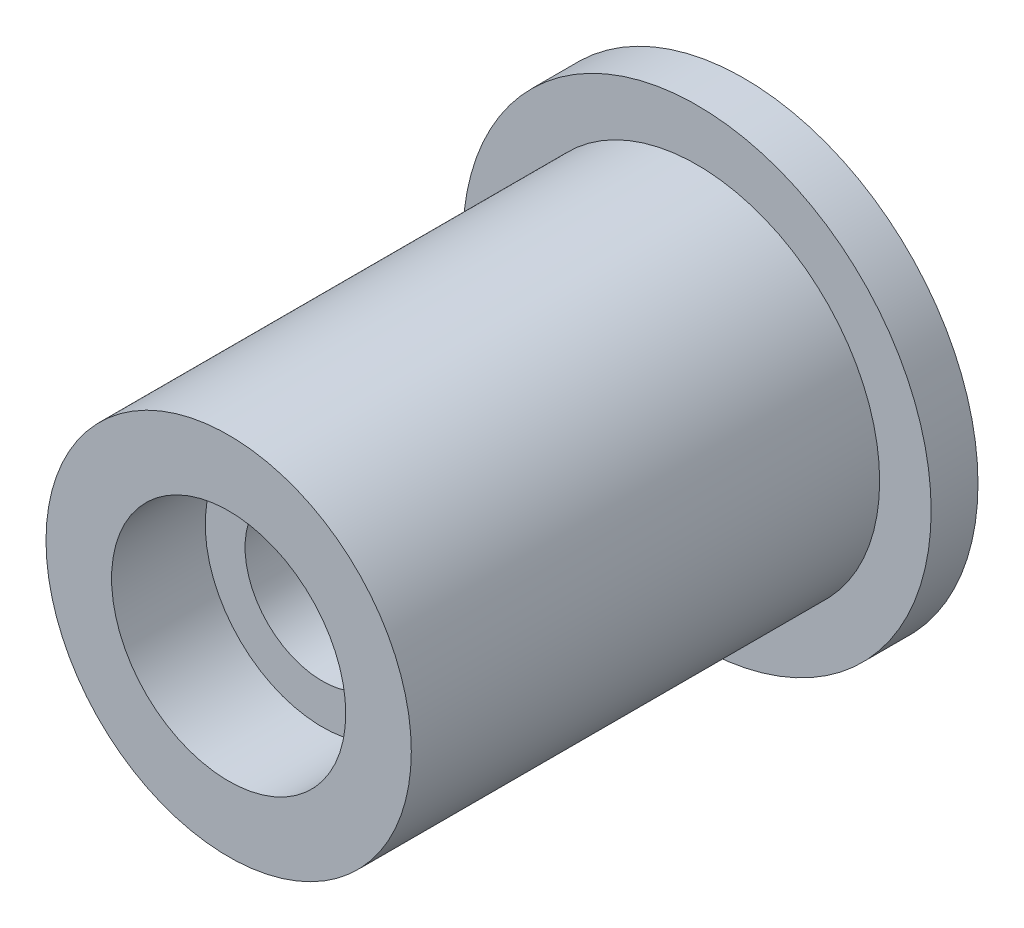
ISO-10303-21;
HEADER;
FILE_DESCRIPTION(('STEP AP214'),'2;1');
FILE_NAME('part.step','',(''),(''),'','','');
FILE_SCHEMA(('AUTOMOTIVE_DESIGN { 1 0 10303 214 1 1 1 1 }'));
ENDSEC;
DATA;
#1=APPLICATION_CONTEXT('core data for automotive mechanical design processes');
#2=APPLICATION_PROTOCOL_DEFINITION('international standard','automotive_design',2000,#1);
#3=PRODUCT_CONTEXT('',#1,'mechanical');
#4=PRODUCT('Part','Part','',(#3));
#5=PRODUCT_RELATED_PRODUCT_CATEGORY('part','',(#4));
#6=PRODUCT_DEFINITION_FORMATION('','',#4);
#7=PRODUCT_DEFINITION_CONTEXT('part definition',#1,'design');
#8=PRODUCT_DEFINITION('design','',#6,#7);
#9=PRODUCT_DEFINITION_SHAPE('','',#8);
#10=(LENGTH_UNIT() NAMED_UNIT(*) SI_UNIT(.MILLI.,.METRE.));
#11=(NAMED_UNIT(*) PLANE_ANGLE_UNIT() SI_UNIT($,.RADIAN.));
#12=(NAMED_UNIT(*) SI_UNIT($,.STERADIAN.) SOLID_ANGLE_UNIT());
#13=UNCERTAINTY_MEASURE_WITH_UNIT(LENGTH_MEASURE(1.E-05),#10,'distance_accuracy_value','');
#14=(GEOMETRIC_REPRESENTATION_CONTEXT(3) GLOBAL_UNCERTAINTY_ASSIGNED_CONTEXT((#13)) GLOBAL_UNIT_ASSIGNED_CONTEXT((#10,
#11,#12)) REPRESENTATION_CONTEXT('',''));
#15=CARTESIAN_POINT('',(0.,0.,0.));
#16=DIRECTION('',(0.,0.,1.));
#17=DIRECTION('',(1.,0.,0.));
#18=AXIS2_PLACEMENT_3D('',#15,#16,#17);
#19=CARTESIAN_POINT('',(0.,0.,-1.));
#20=DIRECTION('',(0.,0.,1.));
#21=DIRECTION('',(1.,0.,0.));
#22=AXIS2_PLACEMENT_3D('',#19,#20,#21);
#23=CYLINDRICAL_SURFACE('',#22,5.);
#24=CARTESIAN_POINT('',(0.,0.,-1.));
#25=DIRECTION('',(0.,0.,1.));
#26=DIRECTION('',(1.,0.,0.));
#27=AXIS2_PLACEMENT_3D('',#24,#25,#26);
#28=CIRCLE('',#27,5.);
#29=CARTESIAN_POINT('',(5.,0.,-1.));
#30=VERTEX_POINT('',#29);
#31=EDGE_CURVE('E59',#30,#30,#28,.T.);
#32=ORIENTED_EDGE('',*,*,#31,.T.);
#33=EDGE_LOOP('',(#32));
#34=FACE_BOUND('',#33,.T.);
#35=CARTESIAN_POINT('',(0.,0.,0.));
#36=DIRECTION('',(0.,0.,1.));
#37=DIRECTION('',(1.,0.,0.));
#38=AXIS2_PLACEMENT_3D('',#35,#36,#37);
#39=CIRCLE('',#38,5.);
#40=CARTESIAN_POINT('',(5.,0.,0.));
#41=VERTEX_POINT('',#40);
#42=EDGE_CURVE('E64',#41,#41,#39,.T.);
#43=ORIENTED_EDGE('',*,*,#42,.F.);
#44=EDGE_LOOP('',(#43));
#45=FACE_BOUND('',#44,.T.);
#46=ADVANCED_FACE('F49',(#34,#45),#23,.T.);
#47=CARTESIAN_POINT('',(0.,0.,-1.));
#48=DIRECTION('',(0.,0.,1.));
#49=DIRECTION('',(1.,0.,0.));
#50=AXIS2_PLACEMENT_3D('',#47,#48,#49);
#51=PLANE('',#50);
#52=CARTESIAN_POINT('',(0.,0.,-1.));
#53=DIRECTION('',(0.,0.,1.));
#54=DIRECTION('',(1.,0.,0.));
#55=AXIS2_PLACEMENT_3D('',#52,#53,#54);
#56=CIRCLE('',#55,1.65);
#57=CARTESIAN_POINT('',(1.65,0.,-1.));
#58=VERTEX_POINT('',#57);
#59=EDGE_CURVE('E70',#58,#58,#56,.T.);
#60=ORIENTED_EDGE('',*,*,#59,.T.);
#61=EDGE_LOOP('',(#60));
#62=FACE_BOUND('',#61,.T.);
#63=ORIENTED_EDGE('',*,*,#31,.F.);
#64=EDGE_LOOP('',(#63));
#65=FACE_BOUND('',#64,.T.);
#66=ADVANCED_FACE('F78',(#62,#65),#51,.F.);
#67=CARTESIAN_POINT('',(0.,0.,0.));
#68=DIRECTION('',(0.,0.,1.));
#69=DIRECTION('',(1.,0.,0.));
#70=AXIS2_PLACEMENT_3D('',#67,#68,#69);
#71=PLANE('',#70);
#72=CARTESIAN_POINT('',(0.,0.,0.));
#73=DIRECTION('',(0.,0.,1.));
#74=DIRECTION('',(1.,0.,0.));
#75=AXIS2_PLACEMENT_3D('',#72,#73,#74);
#76=CIRCLE('',#75,3.9);
#77=CARTESIAN_POINT('',(3.9,0.,0.));
#78=VERTEX_POINT('',#77);
#79=EDGE_CURVE('E55',#78,#78,#76,.T.);
#80=ORIENTED_EDGE('',*,*,#79,.F.);
#81=EDGE_LOOP('',(#80));
#82=FACE_BOUND('',#81,.T.);
#83=ORIENTED_EDGE('',*,*,#42,.T.);
#84=EDGE_LOOP('',(#83));
#85=FACE_BOUND('',#84,.T.);
#86=ADVANCED_FACE('F75',(#82,#85),#71,.T.);
#87=CARTESIAN_POINT('',(0.,0.,-1.));
#88=DIRECTION('',(0.,0.,1.));
#89=DIRECTION('',(1.,0.,0.));
#90=AXIS2_PLACEMENT_3D('',#87,#88,#89);
#91=CYLINDRICAL_SURFACE('',#90,1.65);
#92=ORIENTED_EDGE('',*,*,#59,.F.);
#93=EDGE_LOOP('',(#92));
#94=FACE_BOUND('',#93,.T.);
#95=CARTESIAN_POINT('',(0.,0.,8.));
#96=DIRECTION('',(0.,0.,1.));
#97=DIRECTION('',(1.,0.,0.));
#98=AXIS2_PLACEMENT_3D('',#95,#96,#97);
#99=CIRCLE('',#98,1.65);
#100=CARTESIAN_POINT('',(1.65,0.,8.));
#101=VERTEX_POINT('',#100);
#102=EDGE_CURVE('E115',#101,#101,#99,.T.);
#103=ORIENTED_EDGE('',*,*,#102,.T.);
#104=EDGE_LOOP('',(#103));
#105=FACE_BOUND('',#104,.T.);
#106=ADVANCED_FACE('F90',(#94,#105),#91,.F.);
#107=CARTESIAN_POINT('',(0.,0.,10.));
#108=DIRECTION('',(0.,0.,-1.));
#109=DIRECTION('',(-1.,0.,0.));
#110=AXIS2_PLACEMENT_3D('',#107,#108,#109);
#111=CYLINDRICAL_SURFACE('',#110,2.5);
#112=CARTESIAN_POINT('',(0.,0.,8.));
#113=DIRECTION('',(0.,0.,1.));
#114=DIRECTION('',(1.,0.,0.));
#115=AXIS2_PLACEMENT_3D('',#112,#113,#114);
#116=CIRCLE('',#115,2.5);
#117=CARTESIAN_POINT('',(2.5,0.,8.));
#118=VERTEX_POINT('',#117);
#119=EDGE_CURVE('E11',#118,#118,#116,.T.);
#120=ORIENTED_EDGE('',*,*,#119,.F.);
#121=EDGE_LOOP('',(#120));
#122=FACE_BOUND('',#121,.T.);
#123=CARTESIAN_POINT('',(0.,0.,10.));
#124=DIRECTION('',(0.,0.,1.));
#125=DIRECTION('',(1.,0.,0.));
#126=AXIS2_PLACEMENT_3D('',#123,#124,#125);
#127=CIRCLE('',#126,2.5);
#128=CARTESIAN_POINT('',(2.5,0.,10.));
#129=VERTEX_POINT('',#128);
#130=EDGE_CURVE('E117',#129,#129,#127,.T.);
#131=ORIENTED_EDGE('',*,*,#130,.T.);
#132=EDGE_LOOP('',(#131));
#133=FACE_BOUND('',#132,.T.);
#134=ADVANCED_FACE('F95',(#122,#133),#111,.F.);
#135=CARTESIAN_POINT('',(0.,0.,10.));
#136=DIRECTION('',(0.,0.,-1.));
#137=DIRECTION('',(-1.,0.,0.));
#138=AXIS2_PLACEMENT_3D('',#135,#136,#137);
#139=CYLINDRICAL_SURFACE('',#138,3.9);
#140=CARTESIAN_POINT('',(0.,0.,10.));
#141=DIRECTION('',(0.,0.,1.));
#142=DIRECTION('',(1.,0.,0.));
#143=AXIS2_PLACEMENT_3D('',#140,#141,#142);
#144=CIRCLE('',#143,3.9);
#145=CARTESIAN_POINT('',(3.9,0.,10.));
#146=VERTEX_POINT('',#145);
#147=EDGE_CURVE('E68',#146,#146,#144,.T.);
#148=ORIENTED_EDGE('',*,*,#147,.F.);
#149=EDGE_LOOP('',(#148));
#150=FACE_BOUND('',#149,.T.);
#151=ORIENTED_EDGE('',*,*,#79,.T.);
#152=EDGE_LOOP('',(#151));
#153=FACE_BOUND('',#152,.T.);
#154=ADVANCED_FACE('F99',(#150,#153),#139,.T.);
#155=CARTESIAN_POINT('',(0.,0.,10.));
#156=DIRECTION('',(0.,0.,1.));
#157=DIRECTION('',(1.,0.,0.));
#158=AXIS2_PLACEMENT_3D('',#155,#156,#157);
#159=PLANE('',#158);
#160=ORIENTED_EDGE('',*,*,#130,.F.);
#161=EDGE_LOOP('',(#160));
#162=FACE_BOUND('',#161,.T.);
#163=ORIENTED_EDGE('',*,*,#147,.T.);
#164=EDGE_LOOP('',(#163));
#165=FACE_BOUND('',#164,.T.);
#166=ADVANCED_FACE('F103',(#162,#165),#159,.T.);
#167=CARTESIAN_POINT('',(0.,0.,8.));
#168=DIRECTION('',(0.,0.,1.));
#169=DIRECTION('',(1.,0.,0.));
#170=AXIS2_PLACEMENT_3D('',#167,#168,#169);
#171=PLANE('',#170);
#172=ORIENTED_EDGE('',*,*,#102,.F.);
#173=EDGE_LOOP('',(#172));
#174=FACE_BOUND('',#173,.T.);
#175=ORIENTED_EDGE('',*,*,#119,.T.);
#176=EDGE_LOOP('',(#175));
#177=FACE_BOUND('',#176,.T.);
#178=ADVANCED_FACE('F107',(#174,#177),#171,.T.);
#179=CLOSED_SHELL('',(#46,#66,#86,#106,#134,#154,#166,#178));
#180=MANIFOLD_SOLID_BREP('B2',#179);
#181=ADVANCED_BREP_SHAPE_REPRESENTATION('',(#18,#180),#14);
#182=SHAPE_DEFINITION_REPRESENTATION(#9,#181);
ENDSEC;
END-ISO-10303-21;
